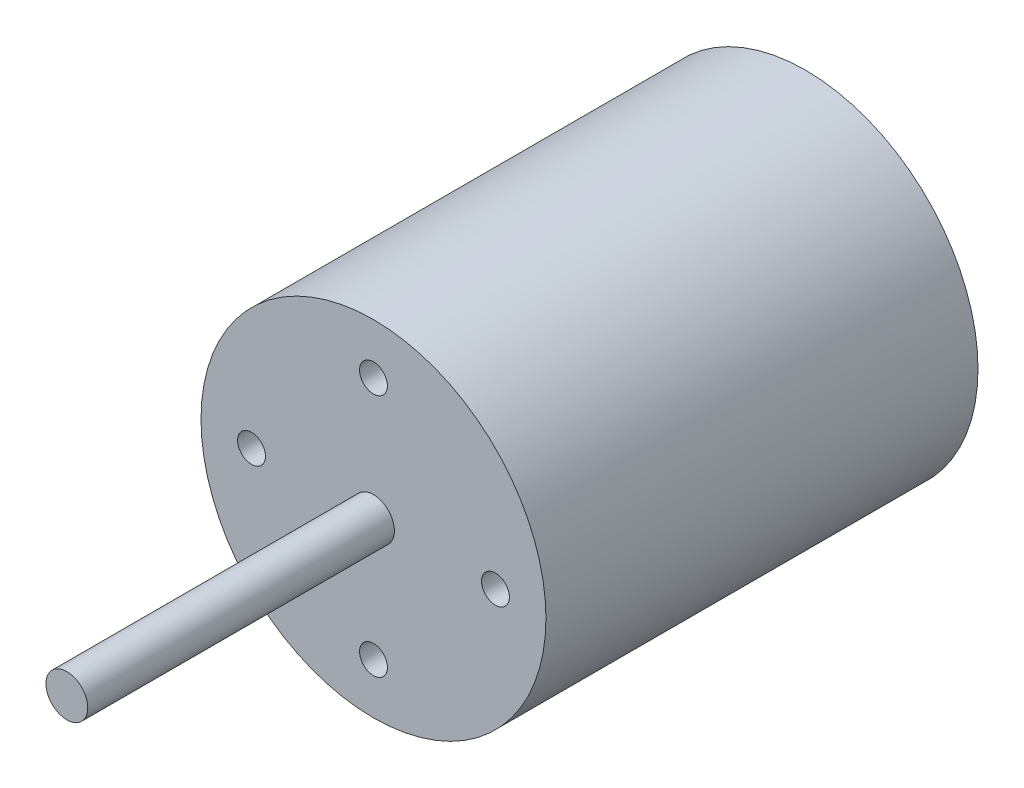
ISO-10303-21;
HEADER;
FILE_DESCRIPTION(('STEP AP214'),'2;1');
FILE_NAME('part.step','',(''),(''),'','','');
FILE_SCHEMA(('AUTOMOTIVE_DESIGN { 1 0 10303 214 1 1 1 1 }'));
ENDSEC;
DATA;
#1=APPLICATION_CONTEXT('core data for automotive mechanical design processes');
#2=APPLICATION_PROTOCOL_DEFINITION('international standard','automotive_design',2000,#1);
#3=PRODUCT_CONTEXT('',#1,'mechanical');
#4=PRODUCT('Part','Part','',(#3));
#5=PRODUCT_RELATED_PRODUCT_CATEGORY('part','',(#4));
#6=PRODUCT_DEFINITION_FORMATION('','',#4);
#7=PRODUCT_DEFINITION_CONTEXT('part definition',#1,'design');
#8=PRODUCT_DEFINITION('design','',#6,#7);
#9=PRODUCT_DEFINITION_SHAPE('','',#8);
#10=(LENGTH_UNIT() NAMED_UNIT(*) SI_UNIT(.MILLI.,.METRE.));
#11=(NAMED_UNIT(*) PLANE_ANGLE_UNIT() SI_UNIT($,.RADIAN.));
#12=(NAMED_UNIT(*) SI_UNIT($,.STERADIAN.) SOLID_ANGLE_UNIT());
#13=UNCERTAINTY_MEASURE_WITH_UNIT(LENGTH_MEASURE(1.E-05),#10,'distance_accuracy_value','');
#14=(GEOMETRIC_REPRESENTATION_CONTEXT(3) GLOBAL_UNCERTAINTY_ASSIGNED_CONTEXT((#13)) GLOBAL_UNIT_ASSIGNED_CONTEXT((#10,
#11,#12)) REPRESENTATION_CONTEXT('',''));
#15=CARTESIAN_POINT('',(0.,0.,0.));
#16=DIRECTION('',(0.,0.,1.));
#17=DIRECTION('',(1.,0.,0.));
#18=AXIS2_PLACEMENT_3D('',#15,#16,#17);
#19=CARTESIAN_POINT('',(0.,0.,-31.));
#20=DIRECTION('',(0.,0.,1.));
#21=DIRECTION('',(1.,0.,0.));
#22=AXIS2_PLACEMENT_3D('',#19,#20,#21);
#23=CYLINDRICAL_SURFACE('',#22,24.75);
#24=CARTESIAN_POINT('',(0.,0.,-31.));
#25=DIRECTION('',(0.,0.,1.));
#26=DIRECTION('',(1.,0.,0.));
#27=AXIS2_PLACEMENT_3D('',#24,#25,#26);
#28=CIRCLE('',#27,24.75);
#29=CARTESIAN_POINT('',(24.75,0.,-31.));
#30=VERTEX_POINT('',#29);
#31=EDGE_CURVE('E44',#30,#30,#28,.T.);
#32=ORIENTED_EDGE('',*,*,#31,.T.);
#33=EDGE_LOOP('',(#32));
#34=FACE_BOUND('',#33,.T.);
#35=CARTESIAN_POINT('',(0.,0.,31.));
#36=DIRECTION('',(0.,0.,1.));
#37=DIRECTION('',(1.,0.,0.));
#38=AXIS2_PLACEMENT_3D('',#35,#36,#37);
#39=CIRCLE('',#38,24.75);
#40=CARTESIAN_POINT('',(24.75,0.,31.));
#41=VERTEX_POINT('',#40);
#42=EDGE_CURVE('E49',#41,#41,#39,.T.);
#43=ORIENTED_EDGE('',*,*,#42,.F.);
#44=EDGE_LOOP('',(#43));
#45=FACE_BOUND('',#44,.T.);
#46=ADVANCED_FACE('F37',(#34,#45),#23,.T.);
#47=CARTESIAN_POINT('',(0.,0.,-31.));
#48=DIRECTION('',(0.,0.,1.));
#49=DIRECTION('',(1.,0.,0.));
#50=AXIS2_PLACEMENT_3D('',#47,#48,#49);
#51=PLANE('',#50);
#52=CARTESIAN_POINT('',(0.,0.,-31.));
#53=DIRECTION('',(0.,0.,1.));
#54=DIRECTION('',(1.,0.,0.));
#55=AXIS2_PLACEMENT_3D('',#52,#53,#54);
#56=CIRCLE('',#55,9.);
#57=CARTESIAN_POINT('',(9.,0.,-31.));
#58=VERTEX_POINT('',#57);
#59=EDGE_CURVE('E10',#58,#58,#56,.F.);
#60=ORIENTED_EDGE('',*,*,#59,.F.);
#61=EDGE_LOOP('',(#60));
#62=FACE_BOUND('',#61,.T.);
#63=CARTESIAN_POINT('',(-17.5,0.,-31.));
#64=DIRECTION('',(0.,0.,-1.));
#65=DIRECTION('',(1.,0.,0.));
#66=AXIS2_PLACEMENT_3D('',#63,#64,#65);
#67=CIRCLE('',#66,2.);
#68=CARTESIAN_POINT('',(-15.5,0.,-31.));
#69=VERTEX_POINT('',#68);
#70=EDGE_CURVE('E105',#69,#69,#67,.T.);
#71=ORIENTED_EDGE('',*,*,#70,.F.);
#72=EDGE_LOOP('',(#71));
#73=FACE_BOUND('',#72,.T.);
#74=CARTESIAN_POINT('',(17.5,0.,-31.));
#75=DIRECTION('',(0.,0.,-1.));
#76=DIRECTION('',(-1.,0.,0.));
#77=AXIS2_PLACEMENT_3D('',#74,#75,#76);
#78=CIRCLE('',#77,2.);
#79=CARTESIAN_POINT('',(15.5,0.,-31.));
#80=VERTEX_POINT('',#79);
#81=EDGE_CURVE('E97',#80,#80,#78,.T.);
#82=ORIENTED_EDGE('',*,*,#81,.F.);
#83=EDGE_LOOP('',(#82));
#84=FACE_BOUND('',#83,.T.);
#85=ORIENTED_EDGE('',*,*,#31,.F.);
#86=EDGE_LOOP('',(#85));
#87=FACE_BOUND('',#86,.T.);
#88=ADVANCED_FACE('F132',(#62,#73,#84,#87),#51,.F.);
#89=CARTESIAN_POINT('',(0.,0.,31.));
#90=DIRECTION('',(0.,0.,1.));
#91=DIRECTION('',(1.,0.,0.));
#92=AXIS2_PLACEMENT_3D('',#89,#90,#91);
#93=PLANE('',#92);
#94=CARTESIAN_POINT('',(-17.5,0.,31.));
#95=DIRECTION('',(0.,0.,1.));
#96=DIRECTION('',(0.,1.,0.));
#97=AXIS2_PLACEMENT_3D('',#94,#95,#96);
#98=CIRCLE('',#97,2.);
#99=CARTESIAN_POINT('',(-17.5,1.99999999999994,31.));
#100=VERTEX_POINT('',#99);
#101=EDGE_CURVE('E90',#100,#100,#98,.T.);
#102=ORIENTED_EDGE('',*,*,#101,.F.);
#103=EDGE_LOOP('',(#102));
#104=FACE_BOUND('',#103,.T.);
#105=CARTESIAN_POINT('',(0.,-17.5,31.));
#106=DIRECTION('',(0.,0.,1.));
#107=DIRECTION('',(-1.,0.,0.));
#108=AXIS2_PLACEMENT_3D('',#105,#106,#107);
#109=CIRCLE('',#108,2.);
#110=CARTESIAN_POINT('',(-2.,-17.5,31.));
#111=VERTEX_POINT('',#110);
#112=EDGE_CURVE('E82',#111,#111,#109,.T.);
#113=ORIENTED_EDGE('',*,*,#112,.F.);
#114=EDGE_LOOP('',(#113));
#115=FACE_BOUND('',#114,.T.);
#116=CARTESIAN_POINT('',(17.5,1.83302770289265E-13,31.));
#117=DIRECTION('',(0.,0.,1.));
#118=DIRECTION('',(0.,-1.,0.));
#119=AXIS2_PLACEMENT_3D('',#116,#117,#118);
#120=CIRCLE('',#119,2.);
#121=CARTESIAN_POINT('',(17.5,-1.99999999999982,31.));
#122=VERTEX_POINT('',#121);
#123=EDGE_CURVE('E73',#122,#122,#120,.T.);
#124=ORIENTED_EDGE('',*,*,#123,.F.);
#125=EDGE_LOOP('',(#124));
#126=FACE_BOUND('',#125,.T.);
#127=CARTESIAN_POINT('',(0.,17.5,31.));
#128=DIRECTION('',(0.,0.,1.));
#129=DIRECTION('',(1.,0.,0.));
#130=AXIS2_PLACEMENT_3D('',#127,#128,#129);
#131=CIRCLE('',#130,2.);
#132=CARTESIAN_POINT('',(2.,17.5,31.));
#133=VERTEX_POINT('',#132);
#134=EDGE_CURVE('E65',#133,#133,#131,.T.);
#135=ORIENTED_EDGE('',*,*,#134,.F.);
#136=EDGE_LOOP('',(#135));
#137=FACE_BOUND('',#136,.T.);
#138=CARTESIAN_POINT('',(0.,0.,31.));
#139=DIRECTION('',(0.,0.,1.));
#140=DIRECTION('',(1.,0.,0.));
#141=AXIS2_PLACEMENT_3D('',#138,#139,#140);
#142=CIRCLE('',#141,3.);
#143=CARTESIAN_POINT('',(3.,0.,31.));
#144=VERTEX_POINT('',#143);
#145=EDGE_CURVE('E57',#144,#144,#142,.T.);
#146=ORIENTED_EDGE('',*,*,#145,.F.);
#147=EDGE_LOOP('',(#146));
#148=FACE_BOUND('',#147,.T.);
#149=ORIENTED_EDGE('',*,*,#42,.T.);
#150=EDGE_LOOP('',(#149));
#151=FACE_BOUND('',#150,.T.);
#152=ADVANCED_FACE('F136',(#104,#115,#126,#137,#148,#151),#93,.T.);
#153=CARTESIAN_POINT('',(0.,0.,75.));
#154=DIRECTION('',(0.,0.,-1.));
#155=DIRECTION('',(-1.,0.,0.));
#156=AXIS2_PLACEMENT_3D('',#153,#154,#155);
#157=CYLINDRICAL_SURFACE('',#156,3.);
#158=CARTESIAN_POINT('',(0.,0.,75.));
#159=DIRECTION('',(0.,0.,1.));
#160=DIRECTION('',(1.,0.,0.));
#161=AXIS2_PLACEMENT_3D('',#158,#159,#160);
#162=CIRCLE('',#161,3.);
#163=CARTESIAN_POINT('',(3.,0.,75.));
#164=VERTEX_POINT('',#163);
#165=EDGE_CURVE('E55',#164,#164,#162,.T.);
#166=ORIENTED_EDGE('',*,*,#165,.F.);
#167=EDGE_LOOP('',(#166));
#168=FACE_BOUND('',#167,.T.);
#169=ORIENTED_EDGE('',*,*,#145,.T.);
#170=EDGE_LOOP('',(#169));
#171=FACE_BOUND('',#170,.T.);
#172=ADVANCED_FACE('F143',(#168,#171),#157,.T.);
#173=CARTESIAN_POINT('',(0.,0.,75.));
#174=DIRECTION('',(0.,0.,1.));
#175=DIRECTION('',(1.,0.,0.));
#176=AXIS2_PLACEMENT_3D('',#173,#174,#175);
#177=PLANE('',#176);
#178=ORIENTED_EDGE('',*,*,#165,.T.);
#179=EDGE_LOOP('',(#178));
#180=FACE_BOUND('',#179,.T.);
#181=ADVANCED_FACE('F148',(#180),#177,.T.);
#182=CARTESIAN_POINT('',(0.,17.5,26.));
#183=DIRECTION('',(0.,0.,1.));
#184=DIRECTION('',(1.,0.,0.));
#185=AXIS2_PLACEMENT_3D('',#182,#183,#184);
#186=CYLINDRICAL_SURFACE('',#185,2.);
#187=CARTESIAN_POINT('',(0.,17.5,26.));
#188=DIRECTION('',(0.,0.,1.));
#189=DIRECTION('',(1.,0.,0.));
#190=AXIS2_PLACEMENT_3D('',#187,#188,#189);
#191=CIRCLE('',#190,2.);
#192=CARTESIAN_POINT('',(2.,17.5,26.));
#193=VERTEX_POINT('',#192);
#194=EDGE_CURVE('E61',#193,#193,#191,.T.);
#195=ORIENTED_EDGE('',*,*,#194,.F.);
#196=EDGE_LOOP('',(#195));
#197=FACE_BOUND('',#196,.T.);
#198=ORIENTED_EDGE('',*,*,#134,.T.);
#199=EDGE_LOOP('',(#198));
#200=FACE_BOUND('',#199,.T.);
#201=ADVANCED_FACE('F156',(#197,#200),#186,.F.);
#202=CARTESIAN_POINT('',(0.,17.5,26.));
#203=DIRECTION('',(0.,0.,1.));
#204=DIRECTION('',(1.,0.,0.));
#205=AXIS2_PLACEMENT_3D('',#202,#203,#204);
#206=PLANE('',#205);
#207=ORIENTED_EDGE('',*,*,#194,.T.);
#208=EDGE_LOOP('',(#207));
#209=FACE_BOUND('',#208,.T.);
#210=ADVANCED_FACE('F160',(#209),#206,.T.);
#211=CARTESIAN_POINT('',(17.5,1.83302770289265E-13,26.));
#212=DIRECTION('',(0.,0.,1.));
#213=DIRECTION('',(1.,0.,0.));
#214=AXIS2_PLACEMENT_3D('',#211,#212,#213);
#215=CYLINDRICAL_SURFACE('',#214,2.);
#216=CARTESIAN_POINT('',(17.5,1.83302770289265E-13,26.));
#217=DIRECTION('',(0.,0.,1.));
#218=DIRECTION('',(0.,-1.,0.));
#219=AXIS2_PLACEMENT_3D('',#216,#217,#218);
#220=CIRCLE('',#219,2.);
#221=CARTESIAN_POINT('',(17.5,-1.99999999999982,26.));
#222=VERTEX_POINT('',#221);
#223=EDGE_CURVE('E77',#222,#222,#220,.T.);
#224=ORIENTED_EDGE('',*,*,#223,.F.);
#225=EDGE_LOOP('',(#224));
#226=FACE_BOUND('',#225,.T.);
#227=ORIENTED_EDGE('',*,*,#123,.T.);
#228=EDGE_LOOP('',(#227));
#229=FACE_BOUND('',#228,.T.);
#230=ADVANCED_FACE('F164',(#226,#229),#215,.F.);
#231=CARTESIAN_POINT('',(17.5,1.83302770289265E-13,26.));
#232=DIRECTION('',(0.,0.,1.));
#233=DIRECTION('',(0.,-1.,0.));
#234=AXIS2_PLACEMENT_3D('',#231,#232,#233);
#235=PLANE('',#234);
#236=ORIENTED_EDGE('',*,*,#223,.T.);
#237=EDGE_LOOP('',(#236));
#238=FACE_BOUND('',#237,.T.);
#239=ADVANCED_FACE('F168',(#238),#235,.T.);
#240=CARTESIAN_POINT('',(0.,-17.5,26.));
#241=DIRECTION('',(0.,0.,1.));
#242=DIRECTION('',(1.,0.,0.));
#243=AXIS2_PLACEMENT_3D('',#240,#241,#242);
#244=CYLINDRICAL_SURFACE('',#243,2.);
#245=CARTESIAN_POINT('',(0.,-17.5,26.));
#246=DIRECTION('',(0.,0.,1.));
#247=DIRECTION('',(-1.,0.,0.));
#248=AXIS2_PLACEMENT_3D('',#245,#246,#247);
#249=CIRCLE('',#248,2.);
#250=CARTESIAN_POINT('',(-2.,-17.5,26.));
#251=VERTEX_POINT('',#250);
#252=EDGE_CURVE('E86',#251,#251,#249,.T.);
#253=ORIENTED_EDGE('',*,*,#252,.F.);
#254=EDGE_LOOP('',(#253));
#255=FACE_BOUND('',#254,.T.);
#256=ORIENTED_EDGE('',*,*,#112,.T.);
#257=EDGE_LOOP('',(#256));
#258=FACE_BOUND('',#257,.T.);
#259=ADVANCED_FACE('F172',(#255,#258),#244,.F.);
#260=CARTESIAN_POINT('',(0.,-17.5,26.));
#261=DIRECTION('',(0.,0.,1.));
#262=DIRECTION('',(-1.,0.,0.));
#263=AXIS2_PLACEMENT_3D('',#260,#261,#262);
#264=PLANE('',#263);
#265=ORIENTED_EDGE('',*,*,#252,.T.);
#266=EDGE_LOOP('',(#265));
#267=FACE_BOUND('',#266,.T.);
#268=ADVANCED_FACE('F176',(#267),#264,.T.);
#269=CARTESIAN_POINT('',(-17.5,0.,26.));
#270=DIRECTION('',(0.,0.,1.));
#271=DIRECTION('',(1.,0.,0.));
#272=AXIS2_PLACEMENT_3D('',#269,#270,#271);
#273=CYLINDRICAL_SURFACE('',#272,2.);
#274=CARTESIAN_POINT('',(-17.5,0.,26.));
#275=DIRECTION('',(0.,0.,1.));
#276=DIRECTION('',(0.,1.,0.));
#277=AXIS2_PLACEMENT_3D('',#274,#275,#276);
#278=CIRCLE('',#277,2.);
#279=CARTESIAN_POINT('',(-17.5,1.99999999999994,26.));
#280=VERTEX_POINT('',#279);
#281=EDGE_CURVE('E69',#280,#280,#278,.T.);
#282=ORIENTED_EDGE('',*,*,#281,.F.);
#283=EDGE_LOOP('',(#282));
#284=FACE_BOUND('',#283,.T.);
#285=ORIENTED_EDGE('',*,*,#101,.T.);
#286=EDGE_LOOP('',(#285));
#287=FACE_BOUND('',#286,.T.);
#288=ADVANCED_FACE('F180',(#284,#287),#273,.F.);
#289=CARTESIAN_POINT('',(-17.5,0.,26.));
#290=DIRECTION('',(0.,0.,1.));
#291=DIRECTION('',(0.,1.,0.));
#292=AXIS2_PLACEMENT_3D('',#289,#290,#291);
#293=PLANE('',#292);
#294=ORIENTED_EDGE('',*,*,#281,.T.);
#295=EDGE_LOOP('',(#294));
#296=FACE_BOUND('',#295,.T.);
#297=ADVANCED_FACE('F184',(#296),#293,.T.);
#298=CARTESIAN_POINT('',(17.5,0.,-21.));
#299=DIRECTION('',(0.,0.,-1.));
#300=DIRECTION('',(-1.,0.,0.));
#301=AXIS2_PLACEMENT_3D('',#298,#299,#300);
#302=CYLINDRICAL_SURFACE('',#301,2.);
#303=CARTESIAN_POINT('',(17.5,0.,-21.));
#304=DIRECTION('',(0.,0.,-1.));
#305=DIRECTION('',(-1.,0.,0.));
#306=AXIS2_PLACEMENT_3D('',#303,#304,#305);
#307=CIRCLE('',#306,2.);
#308=CARTESIAN_POINT('',(15.5,0.,-21.));
#309=VERTEX_POINT('',#308);
#310=EDGE_CURVE('E78',#309,#309,#307,.T.);
#311=ORIENTED_EDGE('',*,*,#310,.F.);
#312=EDGE_LOOP('',(#311));
#313=FACE_BOUND('',#312,.T.);
#314=ORIENTED_EDGE('',*,*,#81,.T.);
#315=EDGE_LOOP('',(#314));
#316=FACE_BOUND('',#315,.T.);
#317=ADVANCED_FACE('F188',(#313,#316),#302,.F.);
#318=CARTESIAN_POINT('',(17.5,0.,-21.));
#319=DIRECTION('',(0.,0.,-1.));
#320=DIRECTION('',(-1.,0.,0.));
#321=AXIS2_PLACEMENT_3D('',#318,#319,#320);
#322=PLANE('',#321);
#323=ORIENTED_EDGE('',*,*,#310,.T.);
#324=EDGE_LOOP('',(#323));
#325=FACE_BOUND('',#324,.T.);
#326=ADVANCED_FACE('F192',(#325),#322,.T.);
#327=CARTESIAN_POINT('',(-17.5,0.,-21.));
#328=DIRECTION('',(0.,0.,-1.));
#329=DIRECTION('',(-1.,0.,0.));
#330=AXIS2_PLACEMENT_3D('',#327,#328,#329);
#331=CYLINDRICAL_SURFACE('',#330,2.);
#332=CARTESIAN_POINT('',(-17.5,0.,-21.));
#333=DIRECTION('',(0.,0.,-1.));
#334=DIRECTION('',(1.,0.,0.));
#335=AXIS2_PLACEMENT_3D('',#332,#333,#334);
#336=CIRCLE('',#335,2.);
#337=CARTESIAN_POINT('',(-15.5,0.,-21.));
#338=VERTEX_POINT('',#337);
#339=EDGE_CURVE('E101',#338,#338,#336,.T.);
#340=ORIENTED_EDGE('',*,*,#339,.F.);
#341=EDGE_LOOP('',(#340));
#342=FACE_BOUND('',#341,.T.);
#343=ORIENTED_EDGE('',*,*,#70,.T.);
#344=EDGE_LOOP('',(#343));
#345=FACE_BOUND('',#344,.T.);
#346=ADVANCED_FACE('F128',(#342,#345),#331,.F.);
#347=CARTESIAN_POINT('',(-17.5,0.,-21.));
#348=DIRECTION('',(0.,0.,-1.));
#349=DIRECTION('',(1.,0.,0.));
#350=AXIS2_PLACEMENT_3D('',#347,#348,#349);
#351=PLANE('',#350);
#352=ORIENTED_EDGE('',*,*,#339,.T.);
#353=EDGE_LOOP('',(#352));
#354=FACE_BOUND('',#353,.T.);
#355=ADVANCED_FACE('F121',(#354),#351,.T.);
#356=CARTESIAN_POINT('',(0.,0.,-38.));
#357=DIRECTION('',(0.,0.,1.));
#358=DIRECTION('',(1.,0.,0.));
#359=AXIS2_PLACEMENT_3D('',#356,#357,#358);
#360=CYLINDRICAL_SURFACE('',#359,9.);
#361=CARTESIAN_POINT('',(0.,0.,-38.));
#362=DIRECTION('',(0.,0.,-1.));
#363=DIRECTION('',(-1.,0.,0.));
#364=AXIS2_PLACEMENT_3D('',#361,#362,#363);
#365=CIRCLE('',#364,9.);
#366=CARTESIAN_POINT('',(-9.,0.,-38.));
#367=VERTEX_POINT('',#366);
#368=EDGE_CURVE('E109',#367,#367,#365,.T.);
#369=ORIENTED_EDGE('',*,*,#368,.F.);
#370=EDGE_LOOP('',(#369));
#371=FACE_BOUND('',#370,.T.);
#372=ORIENTED_EDGE('',*,*,#59,.T.);
#373=EDGE_LOOP('',(#372));
#374=FACE_BOUND('',#373,.T.);
#375=ADVANCED_FACE('F119',(#371,#374),#360,.T.);
#376=CARTESIAN_POINT('',(0.,0.,-38.));
#377=DIRECTION('',(0.,0.,-1.));
#378=DIRECTION('',(-1.,0.,0.));
#379=AXIS2_PLACEMENT_3D('',#376,#377,#378);
#380=PLANE('',#379);
#381=ORIENTED_EDGE('',*,*,#368,.T.);
#382=EDGE_LOOP('',(#381));
#383=FACE_BOUND('',#382,.T.);
#384=ADVANCED_FACE('F117',(#383),#380,.T.);
#385=CLOSED_SHELL('',(#46,#88,#152,#172,#181,#201,#210,#230,#239,#259,#268,#288,#297,#317,#326,
#346,#355,#375,#384));
#386=MANIFOLD_SOLID_BREP('B2',#385);
#387=ADVANCED_BREP_SHAPE_REPRESENTATION('',(#18,#386),#14);
#388=SHAPE_DEFINITION_REPRESENTATION(#9,#387);
ENDSEC;
END-ISO-10303-21;
